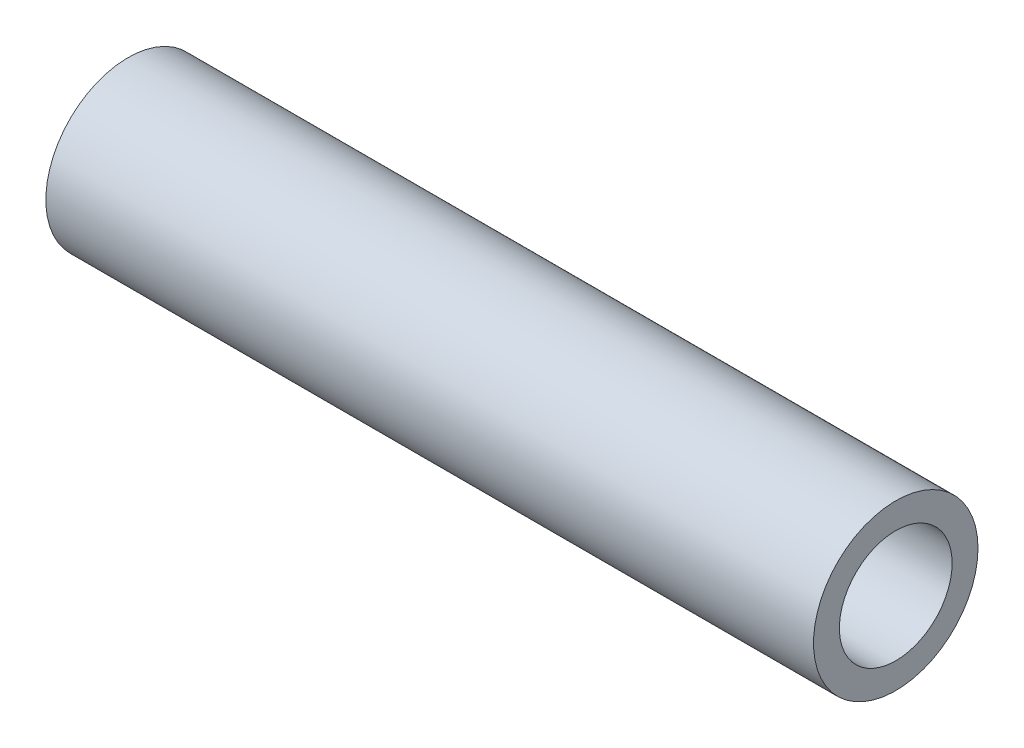
ISO-10303-21;
HEADER;
FILE_DESCRIPTION(('STEP AP214'),'2;1');
FILE_NAME('part.step','',(''),(''),'','','');
FILE_SCHEMA(('AUTOMOTIVE_DESIGN { 1 0 10303 214 1 1 1 1 }'));
ENDSEC;
DATA;
#1=APPLICATION_CONTEXT('core data for automotive mechanical design processes');
#2=APPLICATION_PROTOCOL_DEFINITION('international standard','automotive_design',2000,#1);
#3=PRODUCT_CONTEXT('',#1,'mechanical');
#4=PRODUCT('Part','Part','',(#3));
#5=PRODUCT_RELATED_PRODUCT_CATEGORY('part','',(#4));
#6=PRODUCT_DEFINITION_FORMATION('','',#4);
#7=PRODUCT_DEFINITION_CONTEXT('part definition',#1,'design');
#8=PRODUCT_DEFINITION('design','',#6,#7);
#9=PRODUCT_DEFINITION_SHAPE('','',#8);
#10=(LENGTH_UNIT() NAMED_UNIT(*) SI_UNIT(.MILLI.,.METRE.));
#11=(NAMED_UNIT(*) PLANE_ANGLE_UNIT() SI_UNIT($,.RADIAN.));
#12=(NAMED_UNIT(*) SI_UNIT($,.STERADIAN.) SOLID_ANGLE_UNIT());
#13=UNCERTAINTY_MEASURE_WITH_UNIT(LENGTH_MEASURE(1.E-05),#10,'distance_accuracy_value','');
#14=(GEOMETRIC_REPRESENTATION_CONTEXT(3) GLOBAL_UNCERTAINTY_ASSIGNED_CONTEXT((#13)) GLOBAL_UNIT_ASSIGNED_CONTEXT((#10,
#11,#12)) REPRESENTATION_CONTEXT('',''));
#15=CARTESIAN_POINT('',(0.,0.,0.));
#16=DIRECTION('',(0.,0.,1.));
#17=DIRECTION('',(1.,0.,0.));
#18=AXIS2_PLACEMENT_3D('',#15,#16,#17);
#19=CARTESIAN_POINT('',(22.225,0.,0.));
#20=DIRECTION('',(1.,0.,0.));
#21=DIRECTION('',(0.,0.,-1.));
#22=AXIS2_PLACEMENT_3D('',#19,#20,#21);
#23=CYLINDRICAL_SURFACE('',#22,3.2639);
#24=CARTESIAN_POINT('',(0.,0.,0.));
#25=DIRECTION('',(1.,0.,0.));
#26=DIRECTION('',(0.,0.,-1.));
#27=AXIS2_PLACEMENT_3D('',#24,#25,#26);
#28=CIRCLE('',#27,3.2639);
#29=CARTESIAN_POINT('',(0.,0.,-3.2639));
#30=VERTEX_POINT('',#29);
#31=EDGE_CURVE('E18',#30,#30,#28,.F.);
#32=ORIENTED_EDGE('',*,*,#31,.T.);
#33=EDGE_LOOP('',(#32));
#34=FACE_BOUND('',#33,.T.);
#35=CARTESIAN_POINT('',(44.45,0.,0.));
#36=DIRECTION('',(1.,0.,0.));
#37=DIRECTION('',(0.,0.,-1.));
#38=AXIS2_PLACEMENT_3D('',#35,#36,#37);
#39=CIRCLE('',#38,3.2639);
#40=CARTESIAN_POINT('',(44.45,0.,-3.2639));
#41=VERTEX_POINT('',#40);
#42=EDGE_CURVE('E27',#41,#41,#39,.F.);
#43=ORIENTED_EDGE('',*,*,#42,.F.);
#44=EDGE_LOOP('',(#43));
#45=FACE_BOUND('',#44,.T.);
#46=ADVANCED_FACE('F15',(#34,#45),#23,.F.);
#47=CARTESIAN_POINT('',(0.,0.,0.));
#48=DIRECTION('',(1.,0.,0.));
#49=DIRECTION('',(0.,0.,-1.));
#50=AXIS2_PLACEMENT_3D('',#47,#48,#49);
#51=PLANE('',#50);
#52=ORIENTED_EDGE('',*,*,#31,.F.);
#53=EDGE_LOOP('',(#52));
#54=FACE_BOUND('',#53,.T.);
#55=CARTESIAN_POINT('',(0.,0.,0.));
#56=DIRECTION('',(1.,0.,0.));
#57=DIRECTION('',(0.,0.,-1.));
#58=AXIS2_PLACEMENT_3D('',#55,#56,#57);
#59=CIRCLE('',#58,4.7625);
#60=CARTESIAN_POINT('',(0.,0.,-4.7625));
#61=VERTEX_POINT('',#60);
#62=EDGE_CURVE('E22',#61,#61,#59,.T.);
#63=ORIENTED_EDGE('',*,*,#62,.F.);
#64=EDGE_LOOP('',(#63));
#65=FACE_BOUND('',#64,.T.);
#66=ADVANCED_FACE('F37',(#54,#65),#51,.F.);
#67=CARTESIAN_POINT('',(44.45,0.,0.));
#68=DIRECTION('',(1.,0.,0.));
#69=DIRECTION('',(0.,0.,-1.));
#70=AXIS2_PLACEMENT_3D('',#67,#68,#69);
#71=PLANE('',#70);
#72=ORIENTED_EDGE('',*,*,#42,.T.);
#73=EDGE_LOOP('',(#72));
#74=FACE_BOUND('',#73,.T.);
#75=CARTESIAN_POINT('',(44.45,0.,0.));
#76=DIRECTION('',(1.,0.,0.));
#77=DIRECTION('',(0.,0.,-1.));
#78=AXIS2_PLACEMENT_3D('',#75,#76,#77);
#79=CIRCLE('',#78,4.7625);
#80=CARTESIAN_POINT('',(44.45,0.,-4.7625));
#81=VERTEX_POINT('',#80);
#82=EDGE_CURVE('E10',#81,#81,#79,.F.);
#83=ORIENTED_EDGE('',*,*,#82,.F.);
#84=EDGE_LOOP('',(#83));
#85=FACE_BOUND('',#84,.T.);
#86=ADVANCED_FACE('F40',(#74,#85),#71,.T.);
#87=CARTESIAN_POINT('',(22.225,0.,0.));
#88=DIRECTION('',(1.,0.,0.));
#89=DIRECTION('',(0.,0.,-1.));
#90=AXIS2_PLACEMENT_3D('',#87,#88,#89);
#91=CYLINDRICAL_SURFACE('',#90,4.7625);
#92=ORIENTED_EDGE('',*,*,#62,.T.);
#93=EDGE_LOOP('',(#92));
#94=FACE_BOUND('',#93,.T.);
#95=ORIENTED_EDGE('',*,*,#82,.T.);
#96=EDGE_LOOP('',(#95));
#97=FACE_BOUND('',#96,.T.);
#98=ADVANCED_FACE('F43',(#94,#97),#91,.T.);
#99=CLOSED_SHELL('',(#46,#66,#86,#98));
#100=MANIFOLD_SOLID_BREP('B1',#99);
#101=ADVANCED_BREP_SHAPE_REPRESENTATION('',(#18,#100),#14);
#102=SHAPE_DEFINITION_REPRESENTATION(#9,#101);
ENDSEC;
END-ISO-10303-21;
